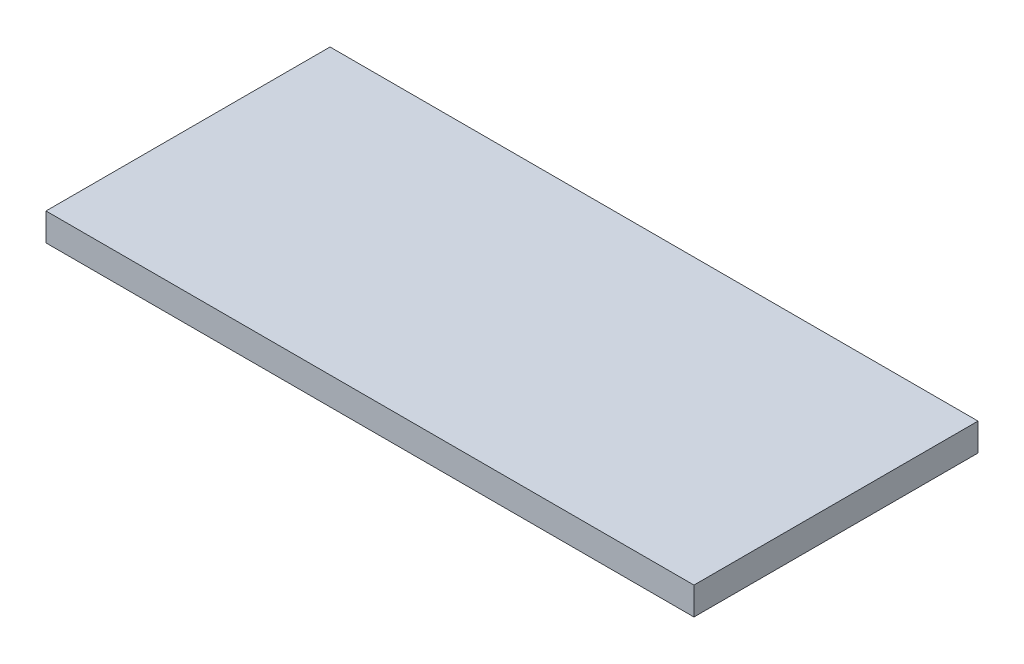
ISO-10303-21;
HEADER;
FILE_DESCRIPTION(('STEP AP214'),'2;1');
FILE_NAME('part.step','',(''),(''),'','','');
FILE_SCHEMA(('AUTOMOTIVE_DESIGN { 1 0 10303 214 1 1 1 1 }'));
ENDSEC;
DATA;
#1=APPLICATION_CONTEXT('core data for automotive mechanical design processes');
#2=APPLICATION_PROTOCOL_DEFINITION('international standard','automotive_design',2000,#1);
#3=PRODUCT_CONTEXT('',#1,'mechanical');
#4=PRODUCT('Part','Part','',(#3));
#5=PRODUCT_RELATED_PRODUCT_CATEGORY('part','',(#4));
#6=PRODUCT_DEFINITION_FORMATION('','',#4);
#7=PRODUCT_DEFINITION_CONTEXT('part definition',#1,'design');
#8=PRODUCT_DEFINITION('design','',#6,#7);
#9=PRODUCT_DEFINITION_SHAPE('','',#8);
#10=(LENGTH_UNIT() NAMED_UNIT(*) SI_UNIT(.MILLI.,.METRE.));
#11=(NAMED_UNIT(*) PLANE_ANGLE_UNIT() SI_UNIT($,.RADIAN.));
#12=(NAMED_UNIT(*) SI_UNIT($,.STERADIAN.) SOLID_ANGLE_UNIT());
#13=UNCERTAINTY_MEASURE_WITH_UNIT(LENGTH_MEASURE(1.E-05),#10,'distance_accuracy_value','');
#14=(GEOMETRIC_REPRESENTATION_CONTEXT(3) GLOBAL_UNCERTAINTY_ASSIGNED_CONTEXT((#13)) GLOBAL_UNIT_ASSIGNED_CONTEXT((#10,
#11,#12)) REPRESENTATION_CONTEXT('',''));
#15=CARTESIAN_POINT('',(0.,0.,0.));
#16=DIRECTION('',(0.,0.,1.));
#17=DIRECTION('',(1.,0.,0.));
#18=AXIS2_PLACEMENT_3D('',#15,#16,#17);
#19=CARTESIAN_POINT('',(0.,1.56,0.));
#20=DIRECTION('',(0.,0.,-1.));
#21=DIRECTION('',(-1.,0.,0.));
#22=AXIS2_PLACEMENT_3D('',#19,#20,#21);
#23=PLANE('',#22);
#24=DIRECTION('',(1.,0.,0.));
#25=VECTOR('',#24,1.);
#26=CARTESIAN_POINT('',(0.,0.,0.));
#27=LINE('',#26,#25);
#28=CARTESIAN_POINT('',(0.,0.,0.));
#29=VERTEX_POINT('',#28);
#30=CARTESIAN_POINT('',(36.5,0.,0.));
#31=VERTEX_POINT('',#30);
#32=EDGE_CURVE('E96',#29,#31,#27,.T.);
#33=ORIENTED_EDGE('',*,*,#32,.T.);
#34=DIRECTION('',(0.,-1.,0.));
#35=VECTOR('',#34,1.);
#36=CARTESIAN_POINT('',(36.5,1.56,0.));
#37=LINE('',#36,#35);
#38=CARTESIAN_POINT('',(36.5,1.56,0.));
#39=VERTEX_POINT('',#38);
#40=EDGE_CURVE('E11',#39,#31,#37,.T.);
#41=ORIENTED_EDGE('',*,*,#40,.F.);
#42=DIRECTION('',(1.,0.,0.));
#43=VECTOR('',#42,1.);
#44=CARTESIAN_POINT('',(0.,1.56,0.));
#45=LINE('',#44,#43);
#46=CARTESIAN_POINT('',(0.,1.56,0.));
#47=VERTEX_POINT('',#46);
#48=EDGE_CURVE('E82',#47,#39,#45,.T.);
#49=ORIENTED_EDGE('',*,*,#48,.F.);
#50=DIRECTION('',(0.,-1.,0.));
#51=VECTOR('',#50,1.);
#52=CARTESIAN_POINT('',(0.,1.56,0.));
#53=LINE('',#52,#51);
#54=EDGE_CURVE('E49',#47,#29,#53,.T.);
#55=ORIENTED_EDGE('',*,*,#54,.T.);
#56=EDGE_LOOP('',(#33,#41,#49,#55));
#57=FACE_BOUND('',#56,.T.);
#58=ADVANCED_FACE('F33',(#57),#23,.F.);
#59=CARTESIAN_POINT('',(36.5,1.56,0.));
#60=DIRECTION('',(-1.,0.,0.));
#61=DIRECTION('',(0.,0.,1.));
#62=AXIS2_PLACEMENT_3D('',#59,#60,#61);
#63=PLANE('',#62);
#64=DIRECTION('',(0.,0.,-1.));
#65=VECTOR('',#64,1.);
#66=CARTESIAN_POINT('',(36.5,0.,0.));
#67=LINE('',#66,#65);
#68=CARTESIAN_POINT('',(36.5,0.,-16.));
#69=VERTEX_POINT('',#68);
#70=EDGE_CURVE('E87',#31,#69,#67,.T.);
#71=ORIENTED_EDGE('',*,*,#70,.T.);
#72=DIRECTION('',(0.,-1.,0.));
#73=VECTOR('',#72,1.);
#74=CARTESIAN_POINT('',(36.5,1.56,-16.));
#75=LINE('',#74,#73);
#76=CARTESIAN_POINT('',(36.5,1.56,-16.));
#77=VERTEX_POINT('',#76);
#78=EDGE_CURVE('E41',#77,#69,#75,.T.);
#79=ORIENTED_EDGE('',*,*,#78,.F.);
#80=DIRECTION('',(0.,0.,-1.));
#81=VECTOR('',#80,1.);
#82=CARTESIAN_POINT('',(36.5,1.56,0.));
#83=LINE('',#82,#81);
#84=EDGE_CURVE('E74',#39,#77,#83,.T.);
#85=ORIENTED_EDGE('',*,*,#84,.F.);
#86=ORIENTED_EDGE('',*,*,#40,.T.);
#87=EDGE_LOOP('',(#71,#79,#85,#86));
#88=FACE_BOUND('',#87,.T.);
#89=ADVANCED_FACE('F86',(#88),#63,.F.);
#90=CARTESIAN_POINT('',(0.,1.56,-16.));
#91=DIRECTION('',(0.,0.,-1.));
#92=DIRECTION('',(-1.,0.,0.));
#93=AXIS2_PLACEMENT_3D('',#90,#91,#92);
#94=PLANE('',#93);
#95=DIRECTION('',(1.,0.,0.));
#96=VECTOR('',#95,1.);
#97=CARTESIAN_POINT('',(0.,0.,-16.));
#98=LINE('',#97,#96);
#99=CARTESIAN_POINT('',(0.,0.,-16.));
#100=VERTEX_POINT('',#99);
#101=EDGE_CURVE('E99',#100,#69,#98,.T.);
#102=ORIENTED_EDGE('',*,*,#101,.F.);
#103=DIRECTION('',(0.,-1.,0.));
#104=VECTOR('',#103,1.);
#105=CARTESIAN_POINT('',(0.,1.56,-16.));
#106=LINE('',#105,#104);
#107=CARTESIAN_POINT('',(0.,1.56,-16.));
#108=VERTEX_POINT('',#107);
#109=EDGE_CURVE('E63',#108,#100,#106,.T.);
#110=ORIENTED_EDGE('',*,*,#109,.F.);
#111=DIRECTION('',(1.,0.,0.));
#112=VECTOR('',#111,1.);
#113=CARTESIAN_POINT('',(0.,1.56,-16.));
#114=LINE('',#113,#112);
#115=EDGE_CURVE('E81',#108,#77,#114,.T.);
#116=ORIENTED_EDGE('',*,*,#115,.T.);
#117=ORIENTED_EDGE('',*,*,#78,.T.);
#118=EDGE_LOOP('',(#102,#110,#116,#117));
#119=FACE_BOUND('',#118,.T.);
#120=ADVANCED_FACE('F90',(#119),#94,.T.);
#121=CARTESIAN_POINT('',(0.,1.56,0.));
#122=DIRECTION('',(-1.,0.,0.));
#123=DIRECTION('',(0.,0.,1.));
#124=AXIS2_PLACEMENT_3D('',#121,#122,#123);
#125=PLANE('',#124);
#126=DIRECTION('',(0.,0.,-1.));
#127=VECTOR('',#126,1.);
#128=CARTESIAN_POINT('',(0.,0.,0.));
#129=LINE('',#128,#127);
#130=EDGE_CURVE('E101',#29,#100,#129,.T.);
#131=ORIENTED_EDGE('',*,*,#130,.F.);
#132=ORIENTED_EDGE('',*,*,#54,.F.);
#133=DIRECTION('',(0.,0.,-1.));
#134=VECTOR('',#133,1.);
#135=CARTESIAN_POINT('',(0.,1.56,0.));
#136=LINE('',#135,#134);
#137=EDGE_CURVE('E91',#47,#108,#136,.T.);
#138=ORIENTED_EDGE('',*,*,#137,.T.);
#139=ORIENTED_EDGE('',*,*,#109,.T.);
#140=EDGE_LOOP('',(#131,#132,#138,#139));
#141=FACE_BOUND('',#140,.T.);
#142=ADVANCED_FACE('F107',(#141),#125,.T.);
#143=CARTESIAN_POINT('',(0.,1.56,0.));
#144=DIRECTION('',(0.,1.,0.));
#145=DIRECTION('',(0.,0.,1.));
#146=AXIS2_PLACEMENT_3D('',#143,#144,#145);
#147=PLANE('',#146);
#148=ORIENTED_EDGE('',*,*,#48,.T.);
#149=ORIENTED_EDGE('',*,*,#84,.T.);
#150=ORIENTED_EDGE('',*,*,#115,.F.);
#151=ORIENTED_EDGE('',*,*,#137,.F.);
#152=EDGE_LOOP('',(#148,#149,#150,#151));
#153=FACE_BOUND('',#152,.T.);
#154=ADVANCED_FACE('F78',(#153),#147,.T.);
#155=CARTESIAN_POINT('',(0.,0.,0.));
#156=DIRECTION('',(0.,1.,0.));
#157=DIRECTION('',(0.,0.,1.));
#158=AXIS2_PLACEMENT_3D('',#155,#156,#157);
#159=PLANE('',#158);
#160=ORIENTED_EDGE('',*,*,#32,.F.);
#161=ORIENTED_EDGE('',*,*,#130,.T.);
#162=ORIENTED_EDGE('',*,*,#101,.T.);
#163=ORIENTED_EDGE('',*,*,#70,.F.);
#164=EDGE_LOOP('',(#160,#161,#162,#163));
#165=FACE_BOUND('',#164,.T.);
#166=ADVANCED_FACE('F106',(#165),#159,.F.);
#167=CLOSED_SHELL('',(#58,#89,#120,#142,#154,#166));
#168=MANIFOLD_SOLID_BREP('B2',#167);
#169=ADVANCED_BREP_SHAPE_REPRESENTATION('',(#18,#168),#14);
#170=SHAPE_DEFINITION_REPRESENTATION(#9,#169);
ENDSEC;
END-ISO-10303-21;
